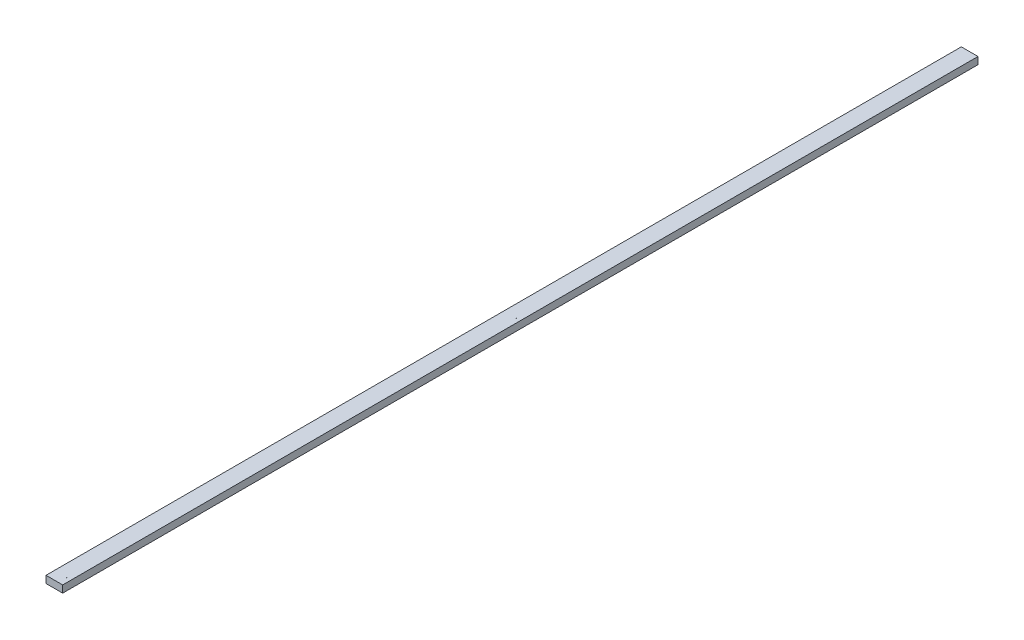
ISO-10303-21;
HEADER;
FILE_DESCRIPTION(('STEP AP214'),'2;1');
FILE_NAME('part.step','',(''),(''),'','','');
FILE_SCHEMA(('AUTOMOTIVE_DESIGN { 1 0 10303 214 1 1 1 1 }'));
ENDSEC;
DATA;
#1=APPLICATION_CONTEXT('core data for automotive mechanical design processes');
#2=APPLICATION_PROTOCOL_DEFINITION('international standard','automotive_design',2000,#1);
#3=PRODUCT_CONTEXT('',#1,'mechanical');
#4=PRODUCT('Part','Part','',(#3));
#5=PRODUCT_RELATED_PRODUCT_CATEGORY('part','',(#4));
#6=PRODUCT_DEFINITION_FORMATION('','',#4);
#7=PRODUCT_DEFINITION_CONTEXT('part definition',#1,'design');
#8=PRODUCT_DEFINITION('design','',#6,#7);
#9=PRODUCT_DEFINITION_SHAPE('','',#8);
#10=(LENGTH_UNIT() NAMED_UNIT(*) SI_UNIT(.MILLI.,.METRE.));
#11=(NAMED_UNIT(*) PLANE_ANGLE_UNIT() SI_UNIT($,.RADIAN.));
#12=(NAMED_UNIT(*) SI_UNIT($,.STERADIAN.) SOLID_ANGLE_UNIT());
#13=UNCERTAINTY_MEASURE_WITH_UNIT(LENGTH_MEASURE(1.E-05),#10,'distance_accuracy_value','');
#14=(GEOMETRIC_REPRESENTATION_CONTEXT(3) GLOBAL_UNCERTAINTY_ASSIGNED_CONTEXT((#13)) GLOBAL_UNIT_ASSIGNED_CONTEXT((#10,
#11,#12)) REPRESENTATION_CONTEXT('',''));
#15=CARTESIAN_POINT('',(0.,0.,0.));
#16=DIRECTION('',(0.,0.,1.));
#17=DIRECTION('',(1.,0.,0.));
#18=AXIS2_PLACEMENT_3D('',#15,#16,#17);
#19=CARTESIAN_POINT('',(0.,0.,4876.8));
#20=DIRECTION('',(1.,0.,0.));
#21=DIRECTION('',(0.,0.,-1.));
#22=AXIS2_PLACEMENT_3D('',#19,#20,#21);
#23=PLANE('',#22);
#24=DIRECTION('',(0.,-1.,0.));
#25=VECTOR('',#24,1.);
#26=CARTESIAN_POINT('',(0.,0.,0.));
#27=LINE('',#26,#25);
#28=CARTESIAN_POINT('',(0.,38.1,0.));
#29=VERTEX_POINT('',#28);
#30=CARTESIAN_POINT('',(0.,0.,0.));
#31=VERTEX_POINT('',#30);
#32=EDGE_CURVE('E96',#29,#31,#27,.T.);
#33=ORIENTED_EDGE('',*,*,#32,.T.);
#34=DIRECTION('',(0.,0.,-1.));
#35=VECTOR('',#34,1.);
#36=CARTESIAN_POINT('',(0.,0.,4876.8));
#37=LINE('',#36,#35);
#38=CARTESIAN_POINT('',(0.,0.,4876.8));
#39=VERTEX_POINT('',#38);
#40=EDGE_CURVE('E11',#39,#31,#37,.T.);
#41=ORIENTED_EDGE('',*,*,#40,.F.);
#42=DIRECTION('',(0.,-1.,0.));
#43=VECTOR('',#42,1.);
#44=CARTESIAN_POINT('',(0.,0.,4876.8));
#45=LINE('',#44,#43);
#46=CARTESIAN_POINT('',(0.,38.1,4876.8));
#47=VERTEX_POINT('',#46);
#48=EDGE_CURVE('E84',#47,#39,#45,.T.);
#49=ORIENTED_EDGE('',*,*,#48,.F.);
#50=DIRECTION('',(0.,0.,-1.));
#51=VECTOR('',#50,1.);
#52=CARTESIAN_POINT('',(0.,38.1,4876.8));
#53=LINE('',#52,#51);
#54=EDGE_CURVE('E92',#47,#29,#53,.T.);
#55=ORIENTED_EDGE('',*,*,#54,.T.);
#56=EDGE_LOOP('',(#33,#41,#49,#55));
#57=FACE_BOUND('',#56,.T.);
#58=ADVANCED_FACE('F33',(#57),#23,.F.);
#59=CARTESIAN_POINT('',(0.,0.,4876.8));
#60=DIRECTION('',(0.,1.,0.));
#61=DIRECTION('',(0.,0.,1.));
#62=AXIS2_PLACEMENT_3D('',#59,#60,#61);
#63=PLANE('',#62);
#64=CARTESIAN_POINT('',(66.6750000000006,0.,4832.35));
#65=DIRECTION('',(0.,1.,0.));
#66=DIRECTION('',(0.,0.,1.));
#67=AXIS2_PLACEMENT_3D('',#64,#65,#66);
#68=CIRCLE('',#67,0.876300000000119);
#69=CARTESIAN_POINT('',(66.6750000000006,0.,4833.2263));
#70=VERTEX_POINT('',#69);
#71=EDGE_CURVE('E139',#70,#70,#68,.F.);
#72=ORIENTED_EDGE('',*,*,#71,.F.);
#73=EDGE_LOOP('',(#72));
#74=FACE_BOUND('',#73,.T.);
#75=CARTESIAN_POINT('',(22.2250000000006,0.,4832.35));
#76=DIRECTION('',(0.,1.,0.));
#77=DIRECTION('',(0.,0.,1.));
#78=AXIS2_PLACEMENT_3D('',#75,#76,#77);
#79=CIRCLE('',#78,0.876300000000115);
#80=CARTESIAN_POINT('',(22.2250000000006,0.,4833.2263));
#81=VERTEX_POINT('',#80);
#82=EDGE_CURVE('E133',#81,#81,#79,.F.);
#83=ORIENTED_EDGE('',*,*,#82,.F.);
#84=EDGE_LOOP('',(#83));
#85=FACE_BOUND('',#84,.T.);
#86=CARTESIAN_POINT('',(22.225,0.,44.45));
#87=DIRECTION('',(0.,1.,0.));
#88=DIRECTION('',(0.,0.,1.));
#89=AXIS2_PLACEMENT_3D('',#86,#87,#88);
#90=CIRCLE('',#89,0.876299999999994);
#91=CARTESIAN_POINT('',(22.225,0.,45.3263));
#92=VERTEX_POINT('',#91);
#93=EDGE_CURVE('E127',#92,#92,#90,.F.);
#94=ORIENTED_EDGE('',*,*,#93,.F.);
#95=EDGE_LOOP('',(#94));
#96=FACE_BOUND('',#95,.T.);
#97=CARTESIAN_POINT('',(66.675,0.,44.45));
#98=DIRECTION('',(0.,1.,0.));
#99=DIRECTION('',(0.,0.,1.));
#100=AXIS2_PLACEMENT_3D('',#97,#98,#99);
#101=CIRCLE('',#100,0.876300000000018);
#102=CARTESIAN_POINT('',(66.675,0.,45.3263));
#103=VERTEX_POINT('',#102);
#104=EDGE_CURVE('E121',#103,#103,#101,.F.);
#105=ORIENTED_EDGE('',*,*,#104,.F.);
#106=EDGE_LOOP('',(#105));
#107=FACE_BOUND('',#106,.T.);
#108=CARTESIAN_POINT('',(22.225,0.,2438.4));
#109=DIRECTION('',(0.,1.,0.));
#110=DIRECTION('',(0.,0.,1.));
#111=AXIS2_PLACEMENT_3D('',#108,#109,#110);
#112=CIRCLE('',#111,0.876299999999976);
#113=CARTESIAN_POINT('',(22.225,0.,2439.2763));
#114=VERTEX_POINT('',#113);
#115=EDGE_CURVE('E115',#114,#114,#112,.F.);
#116=ORIENTED_EDGE('',*,*,#115,.F.);
#117=EDGE_LOOP('',(#116));
#118=FACE_BOUND('',#117,.T.);
#119=CARTESIAN_POINT('',(66.675,0.,2438.4));
#120=DIRECTION('',(0.,1.,0.));
#121=DIRECTION('',(0.,0.,1.));
#122=AXIS2_PLACEMENT_3D('',#119,#120,#121);
#123=CIRCLE('',#122,0.876299999999976);
#124=CARTESIAN_POINT('',(66.675,0.,2439.2763));
#125=VERTEX_POINT('',#124);
#126=EDGE_CURVE('E99',#125,#125,#123,.F.);
#127=ORIENTED_EDGE('',*,*,#126,.F.);
#128=EDGE_LOOP('',(#127));
#129=FACE_BOUND('',#128,.T.);
#130=DIRECTION('',(1.,0.,0.));
#131=VECTOR('',#130,1.);
#132=CARTESIAN_POINT('',(0.,0.,0.));
#133=LINE('',#132,#131);
#134=CARTESIAN_POINT('',(88.9,0.,0.));
#135=VERTEX_POINT('',#134);
#136=EDGE_CURVE('E88',#31,#135,#133,.T.);
#137=ORIENTED_EDGE('',*,*,#136,.T.);
#138=DIRECTION('',(0.,0.,-1.));
#139=VECTOR('',#138,1.);
#140=CARTESIAN_POINT('',(88.9,0.,4876.8));
#141=LINE('',#140,#139);
#142=CARTESIAN_POINT('',(88.9,0.,4876.8));
#143=VERTEX_POINT('',#142);
#144=EDGE_CURVE('E41',#143,#135,#141,.T.);
#145=ORIENTED_EDGE('',*,*,#144,.F.);
#146=DIRECTION('',(1.,0.,0.));
#147=VECTOR('',#146,1.);
#148=CARTESIAN_POINT('',(0.,0.,4876.8));
#149=LINE('',#148,#147);
#150=EDGE_CURVE('E79',#39,#143,#149,.T.);
#151=ORIENTED_EDGE('',*,*,#150,.F.);
#152=ORIENTED_EDGE('',*,*,#40,.T.);
#153=EDGE_LOOP('',(#137,#145,#151,#152));
#154=FACE_BOUND('',#153,.T.);
#155=ADVANCED_FACE('F87',(#74,#85,#96,#107,#118,#129,#154),#63,.F.);
#156=CARTESIAN_POINT('',(88.9,0.,4876.8));
#157=DIRECTION('',(-1.,0.,0.));
#158=DIRECTION('',(0.,0.,1.));
#159=AXIS2_PLACEMENT_3D('',#156,#157,#158);
#160=PLANE('',#159);
#161=DIRECTION('',(0.,1.,0.));
#162=VECTOR('',#161,1.);
#163=CARTESIAN_POINT('',(88.9,0.,0.));
#164=LINE('',#163,#162);
#165=CARTESIAN_POINT('',(88.9,38.1,0.));
#166=VERTEX_POINT('',#165);
#167=EDGE_CURVE('E66',#135,#166,#164,.T.);
#168=ORIENTED_EDGE('',*,*,#167,.T.);
#169=DIRECTION('',(0.,0.,-1.));
#170=VECTOR('',#169,1.);
#171=CARTESIAN_POINT('',(88.9,38.1,4876.8));
#172=LINE('',#171,#170);
#173=CARTESIAN_POINT('',(88.9,38.1,4876.8));
#174=VERTEX_POINT('',#173);
#175=EDGE_CURVE('E89',#174,#166,#172,.T.);
#176=ORIENTED_EDGE('',*,*,#175,.F.);
#177=DIRECTION('',(0.,1.,0.));
#178=VECTOR('',#177,1.);
#179=CARTESIAN_POINT('',(88.9,0.,4876.8));
#180=LINE('',#179,#178);
#181=EDGE_CURVE('E82',#143,#174,#180,.T.);
#182=ORIENTED_EDGE('',*,*,#181,.F.);
#183=ORIENTED_EDGE('',*,*,#144,.T.);
#184=EDGE_LOOP('',(#168,#176,#182,#183));
#185=FACE_BOUND('',#184,.T.);
#186=ADVANCED_FACE('F90',(#185),#160,.F.);
#187=CARTESIAN_POINT('',(0.,38.1,4876.8));
#188=DIRECTION('',(0.,-1.,0.));
#189=DIRECTION('',(0.,0.,-1.));
#190=AXIS2_PLACEMENT_3D('',#187,#188,#189);
#191=PLANE('',#190);
#192=CARTESIAN_POINT('',(66.6750000000006,38.1,4832.35));
#193=DIRECTION('',(0.,1.,0.));
#194=DIRECTION('',(0.,0.,-1.));
#195=AXIS2_PLACEMENT_3D('',#192,#193,#194);
#196=CIRCLE('',#195,0.876300000000119);
#197=CARTESIAN_POINT('',(66.6750000000006,38.1,4831.4737));
#198=VERTEX_POINT('',#197);
#199=EDGE_CURVE('E142',#198,#198,#196,.T.);
#200=ORIENTED_EDGE('',*,*,#199,.F.);
#201=EDGE_LOOP('',(#200));
#202=FACE_BOUND('',#201,.T.);
#203=CARTESIAN_POINT('',(22.2250000000006,38.1,4832.35));
#204=DIRECTION('',(0.,1.,0.));
#205=DIRECTION('',(0.,0.,-1.));
#206=AXIS2_PLACEMENT_3D('',#203,#204,#205);
#207=CIRCLE('',#206,0.876300000000115);
#208=CARTESIAN_POINT('',(22.2250000000006,38.1,4831.4737));
#209=VERTEX_POINT('',#208);
#210=EDGE_CURVE('E136',#209,#209,#207,.T.);
#211=ORIENTED_EDGE('',*,*,#210,.F.);
#212=EDGE_LOOP('',(#211));
#213=FACE_BOUND('',#212,.T.);
#214=CARTESIAN_POINT('',(22.225,38.1,44.45));
#215=DIRECTION('',(0.,1.,0.));
#216=DIRECTION('',(0.,0.,1.));
#217=AXIS2_PLACEMENT_3D('',#214,#215,#216);
#218=CIRCLE('',#217,0.876299999999994);
#219=CARTESIAN_POINT('',(22.225,38.1,45.3263));
#220=VERTEX_POINT('',#219);
#221=EDGE_CURVE('E130',#220,#220,#218,.T.);
#222=ORIENTED_EDGE('',*,*,#221,.F.);
#223=EDGE_LOOP('',(#222));
#224=FACE_BOUND('',#223,.T.);
#225=CARTESIAN_POINT('',(66.675,38.1,44.45));
#226=DIRECTION('',(0.,1.,0.));
#227=DIRECTION('',(0.,0.,1.));
#228=AXIS2_PLACEMENT_3D('',#225,#226,#227);
#229=CIRCLE('',#228,0.876300000000018);
#230=CARTESIAN_POINT('',(66.675,38.1,45.3263));
#231=VERTEX_POINT('',#230);
#232=EDGE_CURVE('E124',#231,#231,#229,.T.);
#233=ORIENTED_EDGE('',*,*,#232,.F.);
#234=EDGE_LOOP('',(#233));
#235=FACE_BOUND('',#234,.T.);
#236=CARTESIAN_POINT('',(22.225,38.1,2438.4));
#237=DIRECTION('',(0.,1.,0.));
#238=DIRECTION('',(0.,0.,1.));
#239=AXIS2_PLACEMENT_3D('',#236,#237,#238);
#240=CIRCLE('',#239,0.876299999999976);
#241=CARTESIAN_POINT('',(22.225,38.1,2439.2763));
#242=VERTEX_POINT('',#241);
#243=EDGE_CURVE('E118',#242,#242,#240,.T.);
#244=ORIENTED_EDGE('',*,*,#243,.F.);
#245=EDGE_LOOP('',(#244));
#246=FACE_BOUND('',#245,.T.);
#247=CARTESIAN_POINT('',(66.675,38.1,2438.4));
#248=DIRECTION('',(0.,1.,0.));
#249=DIRECTION('',(0.,0.,1.));
#250=AXIS2_PLACEMENT_3D('',#247,#248,#249);
#251=CIRCLE('',#250,0.876299999999976);
#252=CARTESIAN_POINT('',(66.675,38.1,2439.2763));
#253=VERTEX_POINT('',#252);
#254=EDGE_CURVE('E112',#253,#253,#251,.T.);
#255=ORIENTED_EDGE('',*,*,#254,.F.);
#256=EDGE_LOOP('',(#255));
#257=FACE_BOUND('',#256,.T.);
#258=DIRECTION('',(-1.,0.,0.));
#259=VECTOR('',#258,1.);
#260=CARTESIAN_POINT('',(0.,38.1,0.));
#261=LINE('',#260,#259);
#262=EDGE_CURVE('E72',#166,#29,#261,.T.);
#263=ORIENTED_EDGE('',*,*,#262,.T.);
#264=ORIENTED_EDGE('',*,*,#54,.F.);
#265=DIRECTION('',(-1.,0.,0.));
#266=VECTOR('',#265,1.);
#267=CARTESIAN_POINT('',(0.,38.1,4876.8));
#268=LINE('',#267,#266);
#269=EDGE_CURVE('E49',#174,#47,#268,.T.);
#270=ORIENTED_EDGE('',*,*,#269,.F.);
#271=ORIENTED_EDGE('',*,*,#175,.T.);
#272=EDGE_LOOP('',(#263,#264,#270,#271));
#273=FACE_BOUND('',#272,.T.);
#274=ADVANCED_FACE('F104',(#202,#213,#224,#235,#246,#257,#273),#191,.F.);
#275=CARTESIAN_POINT('',(0.,0.,4876.8));
#276=DIRECTION('',(0.,0.,-1.));
#277=DIRECTION('',(-1.,0.,0.));
#278=AXIS2_PLACEMENT_3D('',#275,#276,#277);
#279=PLANE('',#278);
#280=ORIENTED_EDGE('',*,*,#48,.T.);
#281=ORIENTED_EDGE('',*,*,#150,.T.);
#282=ORIENTED_EDGE('',*,*,#181,.T.);
#283=ORIENTED_EDGE('',*,*,#269,.T.);
#284=EDGE_LOOP('',(#280,#281,#282,#283));
#285=FACE_BOUND('',#284,.T.);
#286=ADVANCED_FACE('F80',(#285),#279,.F.);
#287=CARTESIAN_POINT('',(0.,0.,0.));
#288=DIRECTION('',(0.,0.,-1.));
#289=DIRECTION('',(-1.,0.,0.));
#290=AXIS2_PLACEMENT_3D('',#287,#288,#289);
#291=PLANE('',#290);
#292=ORIENTED_EDGE('',*,*,#32,.F.);
#293=ORIENTED_EDGE('',*,*,#262,.F.);
#294=ORIENTED_EDGE('',*,*,#167,.F.);
#295=ORIENTED_EDGE('',*,*,#136,.F.);
#296=EDGE_LOOP('',(#292,#293,#294,#295));
#297=FACE_BOUND('',#296,.T.);
#298=ADVANCED_FACE('F107',(#297),#291,.T.);
#299=CARTESIAN_POINT('',(66.675,-2.47855068941513,2438.4));
#300=DIRECTION('',(0.,1.,0.));
#301=DIRECTION('',(0.,0.,1.));
#302=AXIS2_PLACEMENT_3D('',#299,#300,#301);
#303=CYLINDRICAL_SURFACE('',#302,0.876299999999976);
#304=ORIENTED_EDGE('',*,*,#126,.T.);
#305=EDGE_LOOP('',(#304));
#306=FACE_BOUND('',#305,.T.);
#307=ORIENTED_EDGE('',*,*,#254,.T.);
#308=EDGE_LOOP('',(#307));
#309=FACE_BOUND('',#308,.T.);
#310=ADVANCED_FACE('F161',(#306,#309),#303,.F.);
#311=CARTESIAN_POINT('',(22.225,-2.47855068941513,2438.4));
#312=DIRECTION('',(0.,1.,0.));
#313=DIRECTION('',(0.,0.,1.));
#314=AXIS2_PLACEMENT_3D('',#311,#312,#313);
#315=CYLINDRICAL_SURFACE('',#314,0.876299999999976);
#316=ORIENTED_EDGE('',*,*,#115,.T.);
#317=EDGE_LOOP('',(#316));
#318=FACE_BOUND('',#317,.T.);
#319=ORIENTED_EDGE('',*,*,#243,.T.);
#320=EDGE_LOOP('',(#319));
#321=FACE_BOUND('',#320,.T.);
#322=ADVANCED_FACE('F163',(#318,#321),#315,.F.);
#323=CARTESIAN_POINT('',(66.675,-2.47855068941513,44.45));
#324=DIRECTION('',(0.,1.,0.));
#325=DIRECTION('',(0.,0.,1.));
#326=AXIS2_PLACEMENT_3D('',#323,#324,#325);
#327=CYLINDRICAL_SURFACE('',#326,0.876300000000018);
#328=ORIENTED_EDGE('',*,*,#104,.T.);
#329=EDGE_LOOP('',(#328));
#330=FACE_BOUND('',#329,.T.);
#331=ORIENTED_EDGE('',*,*,#232,.T.);
#332=EDGE_LOOP('',(#331));
#333=FACE_BOUND('',#332,.T.);
#334=ADVANCED_FACE('F170',(#330,#333),#327,.F.);
#335=CARTESIAN_POINT('',(22.225,-2.47855068941513,44.45));
#336=DIRECTION('',(0.,1.,0.));
#337=DIRECTION('',(0.,0.,1.));
#338=AXIS2_PLACEMENT_3D('',#335,#336,#337);
#339=CYLINDRICAL_SURFACE('',#338,0.876299999999994);
#340=ORIENTED_EDGE('',*,*,#93,.T.);
#341=EDGE_LOOP('',(#340));
#342=FACE_BOUND('',#341,.T.);
#343=ORIENTED_EDGE('',*,*,#221,.T.);
#344=EDGE_LOOP('',(#343));
#345=FACE_BOUND('',#344,.T.);
#346=ADVANCED_FACE('F225',(#342,#345),#339,.F.);
#347=CARTESIAN_POINT('',(22.2250000000006,-2.47855068941513,4832.35));
#348=DIRECTION('',(0.,1.,0.));
#349=DIRECTION('',(0.,0.,1.));
#350=AXIS2_PLACEMENT_3D('',#347,#348,#349);
#351=CYLINDRICAL_SURFACE('',#350,0.876300000000115);
#352=ORIENTED_EDGE('',*,*,#82,.T.);
#353=EDGE_LOOP('',(#352));
#354=FACE_BOUND('',#353,.T.);
#355=ORIENTED_EDGE('',*,*,#210,.T.);
#356=EDGE_LOOP('',(#355));
#357=FACE_BOUND('',#356,.T.);
#358=ADVANCED_FACE('F235',(#354,#357),#351,.F.);
#359=CARTESIAN_POINT('',(66.6750000000006,-2.47855068941513,4832.35));
#360=DIRECTION('',(0.,1.,0.));
#361=DIRECTION('',(0.,0.,1.));
#362=AXIS2_PLACEMENT_3D('',#359,#360,#361);
#363=CYLINDRICAL_SURFACE('',#362,0.876300000000119);
#364=ORIENTED_EDGE('',*,*,#71,.T.);
#365=EDGE_LOOP('',(#364));
#366=FACE_BOUND('',#365,.T.);
#367=ORIENTED_EDGE('',*,*,#199,.T.);
#368=EDGE_LOOP('',(#367));
#369=FACE_BOUND('',#368,.T.);
#370=ADVANCED_FACE('F146',(#366,#369),#363,.F.);
#371=CLOSED_SHELL('',(#58,#155,#186,#274,#286,#298,#310,#322,#334,#346,#358,#370));
#372=MANIFOLD_SOLID_BREP('B2',#371);
#373=ADVANCED_BREP_SHAPE_REPRESENTATION('',(#18,#372),#14);
#374=SHAPE_DEFINITION_REPRESENTATION(#9,#373);
ENDSEC;
END-ISO-10303-21;
